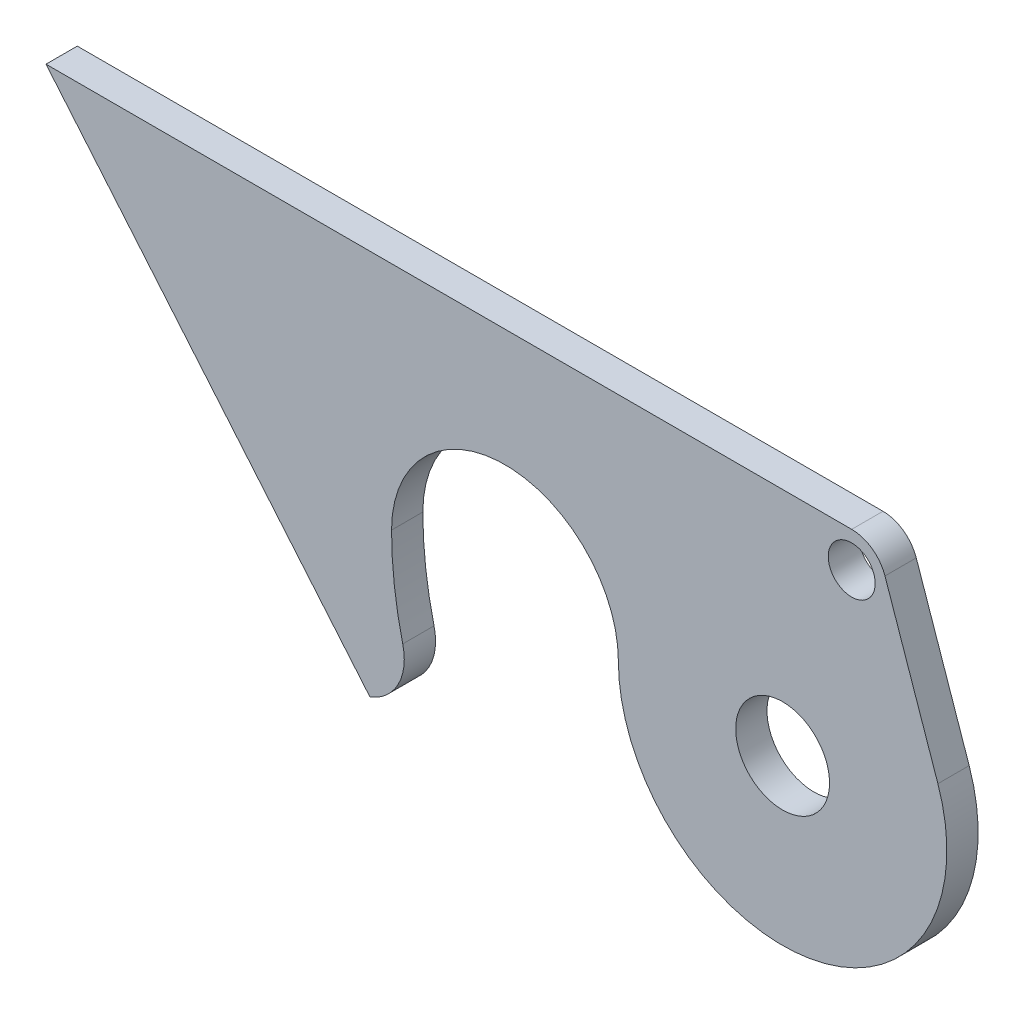
ISO-10303-21;
HEADER;
FILE_DESCRIPTION(('STEP AP214'),'2;1');
FILE_NAME('part.step','',(''),(''),'','','');
FILE_SCHEMA(('AUTOMOTIVE_DESIGN { 1 0 10303 214 1 1 1 1 }'));
ENDSEC;
DATA;
#1=APPLICATION_CONTEXT('core data for automotive mechanical design processes');
#2=APPLICATION_PROTOCOL_DEFINITION('international standard','automotive_design',2000,#1);
#3=PRODUCT_CONTEXT('',#1,'mechanical');
#4=PRODUCT('Part','Part','',(#3));
#5=PRODUCT_RELATED_PRODUCT_CATEGORY('part','',(#4));
#6=PRODUCT_DEFINITION_FORMATION('','',#4);
#7=PRODUCT_DEFINITION_CONTEXT('part definition',#1,'design');
#8=PRODUCT_DEFINITION('design','',#6,#7);
#9=PRODUCT_DEFINITION_SHAPE('','',#8);
#10=(LENGTH_UNIT() NAMED_UNIT(*) SI_UNIT(.MILLI.,.METRE.));
#11=(NAMED_UNIT(*) PLANE_ANGLE_UNIT() SI_UNIT($,.RADIAN.));
#12=(NAMED_UNIT(*) SI_UNIT($,.STERADIAN.) SOLID_ANGLE_UNIT());
#13=UNCERTAINTY_MEASURE_WITH_UNIT(LENGTH_MEASURE(1.E-05),#10,'distance_accuracy_value','');
#14=(GEOMETRIC_REPRESENTATION_CONTEXT(3) GLOBAL_UNCERTAINTY_ASSIGNED_CONTEXT((#13)) GLOBAL_UNIT_ASSIGNED_CONTEXT((#10,
#11,#12)) REPRESENTATION_CONTEXT('',''));
#15=CARTESIAN_POINT('',(0.,0.,0.));
#16=DIRECTION('',(0.,0.,1.));
#17=DIRECTION('',(1.,0.,0.));
#18=AXIS2_PLACEMENT_3D('',#15,#16,#17);
#19=CARTESIAN_POINT('',(-35.5,0.,-4.));
#20=DIRECTION('',(0.,0.,1.));
#21=DIRECTION('',(1.,0.,0.));
#22=AXIS2_PLACEMENT_3D('',#19,#20,#21);
#23=CYLINDRICAL_SURFACE('',#22,14.5);
#24=CARTESIAN_POINT('',(-35.5,0.,0.));
#25=DIRECTION('',(0.,0.,-1.));
#26=DIRECTION('',(1.,0.,0.));
#27=AXIS2_PLACEMENT_3D('',#24,#25,#26);
#28=CIRCLE('',#27,14.5);
#29=CARTESIAN_POINT('',(-50.,0.,0.));
#30=VERTEX_POINT('',#29);
#31=CARTESIAN_POINT('',(-21.,0.,0.));
#32=VERTEX_POINT('',#31);
#33=EDGE_CURVE('E134',#30,#32,#28,.T.);
#34=ORIENTED_EDGE('',*,*,#33,.F.);
#35=DIRECTION('',(0.,0.,1.));
#36=VECTOR('',#35,1.);
#37=CARTESIAN_POINT('',(-50.,0.,-4.));
#38=LINE('',#37,#36);
#39=CARTESIAN_POINT('',(-50.,0.,-4.));
#40=VERTEX_POINT('',#39);
#41=EDGE_CURVE('E11',#40,#30,#38,.T.);
#42=ORIENTED_EDGE('',*,*,#41,.F.);
#43=CARTESIAN_POINT('',(-35.5,0.,-4.));
#44=DIRECTION('',(0.,0.,-1.));
#45=DIRECTION('',(1.,0.,0.));
#46=AXIS2_PLACEMENT_3D('',#43,#44,#45);
#47=CIRCLE('',#46,14.5);
#48=CARTESIAN_POINT('',(-21.,0.,-4.));
#49=VERTEX_POINT('',#48);
#50=EDGE_CURVE('E155',#40,#49,#47,.T.);
#51=ORIENTED_EDGE('',*,*,#50,.T.);
#52=DIRECTION('',(0.,0.,1.));
#53=VECTOR('',#52,1.);
#54=CARTESIAN_POINT('',(-21.,0.,-4.));
#55=LINE('',#54,#53);
#56=EDGE_CURVE('E40',#49,#32,#55,.T.);
#57=ORIENTED_EDGE('',*,*,#56,.T.);
#58=EDGE_LOOP('',(#34,#42,#51,#57));
#59=FACE_BOUND('',#58,.T.);
#60=ADVANCED_FACE('F37',(#59),#23,.F.);
#61=CARTESIAN_POINT('',(0.,0.,-4.));
#62=DIRECTION('',(0.,0.,1.));
#63=DIRECTION('',(1.,0.,0.));
#64=AXIS2_PLACEMENT_3D('',#61,#62,#63);
#65=CYLINDRICAL_SURFACE('',#64,50.);
#66=CARTESIAN_POINT('',(0.,0.,0.));
#67=DIRECTION('',(0.,0.,-1.));
#68=DIRECTION('',(1.,0.,0.));
#69=AXIS2_PLACEMENT_3D('',#66,#67,#68);
#70=CIRCLE('',#69,50.);
#71=CARTESIAN_POINT('',(-48.5665379161614,-11.8866056903581,0.));
#72=VERTEX_POINT('',#71);
#73=EDGE_CURVE('E153',#72,#30,#70,.T.);
#74=ORIENTED_EDGE('',*,*,#73,.F.);
#75=DIRECTION('',(0.,0.,1.));
#76=VECTOR('',#75,1.);
#77=CARTESIAN_POINT('',(-48.5665379161614,-11.8866056903581,-4.));
#78=LINE('',#77,#76);
#79=CARTESIAN_POINT('',(-48.5665379161614,-11.8866056903581,-4.));
#80=VERTEX_POINT('',#79);
#81=EDGE_CURVE('E46',#80,#72,#78,.T.);
#82=ORIENTED_EDGE('',*,*,#81,.F.);
#83=CARTESIAN_POINT('',(0.,0.,-4.));
#84=DIRECTION('',(0.,0.,-1.));
#85=DIRECTION('',(1.,0.,0.));
#86=AXIS2_PLACEMENT_3D('',#83,#84,#85);
#87=CIRCLE('',#86,50.);
#88=EDGE_CURVE('E123',#80,#40,#87,.T.);
#89=ORIENTED_EDGE('',*,*,#88,.T.);
#90=ORIENTED_EDGE('',*,*,#41,.T.);
#91=EDGE_LOOP('',(#74,#82,#89,#90));
#92=FACE_BOUND('',#91,.T.);
#93=ADVANCED_FACE('F168',(#92),#65,.F.);
#94=CARTESIAN_POINT('',(-55.1585775575961,-13.5,-4.));
#95=DIRECTION('',(0.,0.,1.));
#96=DIRECTION('',(1.,0.,0.));
#97=AXIS2_PLACEMENT_3D('',#94,#95,#96);
#98=CYLINDRICAL_SURFACE('',#97,6.78660650344715);
#99=CARTESIAN_POINT('',(-55.1585775575961,-13.5,0.));
#100=DIRECTION('',(0.,0.,1.));
#101=DIRECTION('',(1.,0.,0.));
#102=AXIS2_PLACEMENT_3D('',#99,#100,#101);
#103=CIRCLE('',#102,6.78660650344715);
#104=CARTESIAN_POINT('',(-52.768927380326,-19.8519760596923,0.));
#105=VERTEX_POINT('',#104);
#106=EDGE_CURVE('E111',#105,#72,#103,.T.);
#107=ORIENTED_EDGE('',*,*,#106,.F.);
#108=DIRECTION('',(0.,0.,1.));
#109=VECTOR('',#108,1.);
#110=CARTESIAN_POINT('',(-52.768927380326,-19.8519760596923,-4.));
#111=LINE('',#110,#109);
#112=CARTESIAN_POINT('',(-52.768927380326,-19.8519760596923,-4.));
#113=VERTEX_POINT('',#112);
#114=EDGE_CURVE('E106',#113,#105,#111,.T.);
#115=ORIENTED_EDGE('',*,*,#114,.F.);
#116=CARTESIAN_POINT('',(-55.1585775575961,-13.5,-4.));
#117=DIRECTION('',(0.,0.,1.));
#118=DIRECTION('',(1.,0.,0.));
#119=AXIS2_PLACEMENT_3D('',#116,#117,#118);
#120=CIRCLE('',#119,6.78660650344715);
#121=EDGE_CURVE('E109',#113,#80,#120,.T.);
#122=ORIENTED_EDGE('',*,*,#121,.T.);
#123=ORIENTED_EDGE('',*,*,#81,.T.);
#124=EDGE_LOOP('',(#107,#115,#122,#123));
#125=FACE_BOUND('',#124,.T.);
#126=ADVANCED_FACE('F108',(#125),#98,.T.);
#127=CARTESIAN_POINT('',(-52.768927380326,-19.8519760596923,-4.));
#128=DIRECTION('',(-0.766044443118974,-0.642787609686544,0.));
#129=DIRECTION('',(0.642787609686544,-0.766044443118974,0.));
#130=AXIS2_PLACEMENT_3D('',#127,#128,#129);
#131=PLANE('',#130);
#132=DIRECTION('',(0.642787609686544,-0.766044443118974,0.));
#133=VECTOR('',#132,1.);
#134=CARTESIAN_POINT('',(-52.768927380326,-19.8519760596923,0.));
#135=LINE('',#134,#133);
#136=CARTESIAN_POINT('',(-94.1801522898842,29.5,0.));
#137=VERTEX_POINT('',#136);
#138=EDGE_CURVE('E150',#137,#105,#135,.T.);
#139=ORIENTED_EDGE('',*,*,#138,.F.);
#140=DIRECTION('',(0.,0.,1.));
#141=VECTOR('',#140,1.);
#142=CARTESIAN_POINT('',(-94.1801522898842,29.5,-4.));
#143=LINE('',#142,#141);
#144=CARTESIAN_POINT('',(-94.1801522898842,29.5,-4.));
#145=VERTEX_POINT('',#144);
#146=EDGE_CURVE('E116',#145,#137,#143,.T.);
#147=ORIENTED_EDGE('',*,*,#146,.F.);
#148=DIRECTION('',(0.642787609686544,-0.766044443118974,0.));
#149=VECTOR('',#148,1.);
#150=CARTESIAN_POINT('',(-52.768927380326,-19.8519760596923,-4.));
#151=LINE('',#150,#149);
#152=EDGE_CURVE('E122',#145,#113,#151,.T.);
#153=ORIENTED_EDGE('',*,*,#152,.T.);
#154=ORIENTED_EDGE('',*,*,#114,.T.);
#155=EDGE_LOOP('',(#139,#147,#153,#154));
#156=FACE_BOUND('',#155,.T.);
#157=ADVANCED_FACE('F126',(#156),#131,.T.);
#158=CARTESIAN_POINT('',(-94.1801522898842,29.5,-4.));
#159=DIRECTION('',(0.,1.,0.));
#160=DIRECTION('',(0.,0.,1.));
#161=AXIS2_PLACEMENT_3D('',#158,#159,#160);
#162=PLANE('',#161);
#163=DIRECTION('',(-1.,0.,0.));
#164=VECTOR('',#163,1.);
#165=CARTESIAN_POINT('',(-94.1801522898842,29.5,0.));
#166=LINE('',#165,#164);
#167=CARTESIAN_POINT('',(8.83274998710915,29.5,0.));
#168=VERTEX_POINT('',#167);
#169=EDGE_CURVE('E147',#168,#137,#166,.T.);
#170=ORIENTED_EDGE('',*,*,#169,.F.);
#171=DIRECTION('',(0.,0.,1.));
#172=VECTOR('',#171,1.);
#173=CARTESIAN_POINT('',(8.83274998710915,29.5,-4.));
#174=LINE('',#173,#172);
#175=CARTESIAN_POINT('',(8.83274998710915,29.5,-4.));
#176=VERTEX_POINT('',#175);
#177=EDGE_CURVE('E159',#176,#168,#174,.T.);
#178=ORIENTED_EDGE('',*,*,#177,.F.);
#179=DIRECTION('',(-1.,0.,0.));
#180=VECTOR('',#179,1.);
#181=CARTESIAN_POINT('',(0.,29.5,-4.));
#182=LINE('',#181,#180);
#183=EDGE_CURVE('E127',#176,#145,#182,.T.);
#184=ORIENTED_EDGE('',*,*,#183,.T.);
#185=ORIENTED_EDGE('',*,*,#146,.T.);
#186=EDGE_LOOP('',(#170,#178,#184,#185));
#187=FACE_BOUND('',#186,.T.);
#188=ADVANCED_FACE('F181',(#187),#162,.T.);
#189=CARTESIAN_POINT('',(8.83274998710915,25.0000000000065,-4.));
#190=DIRECTION('',(0.,0.,1.));
#191=DIRECTION('',(1.,0.,0.));
#192=AXIS2_PLACEMENT_3D('',#189,#190,#191);
#193=CYLINDRICAL_SURFACE('',#192,4.49999999999351);
#194=CARTESIAN_POINT('',(8.83274998710915,25.0000000000065,0.));
#195=DIRECTION('',(0.,0.,1.));
#196=DIRECTION('',(1.,0.,0.));
#197=AXIS2_PLACEMENT_3D('',#194,#195,#196);
#198=CIRCLE('',#197,4.49999999999351);
#199=CARTESIAN_POINT('',(13.0869291306046,26.4669559690082,0.));
#200=VERTEX_POINT('',#199);
#201=EDGE_CURVE('E144',#200,#168,#198,.T.);
#202=ORIENTED_EDGE('',*,*,#201,.F.);
#203=DIRECTION('',(0.,0.,1.));
#204=VECTOR('',#203,1.);
#205=CARTESIAN_POINT('',(13.0869291306046,26.4669559690082,-4.));
#206=LINE('',#205,#204);
#207=CARTESIAN_POINT('',(13.0869291306046,26.4669559690082,-4.));
#208=VERTEX_POINT('',#207);
#209=EDGE_CURVE('E162',#208,#200,#206,.T.);
#210=ORIENTED_EDGE('',*,*,#209,.F.);
#211=CARTESIAN_POINT('',(8.83274998710915,25.0000000000065,-4.));
#212=DIRECTION('',(0.,0.,1.));
#213=DIRECTION('',(1.,0.,0.));
#214=AXIS2_PLACEMENT_3D('',#211,#212,#213);
#215=CIRCLE('',#214,4.49999999999351);
#216=EDGE_CURVE('E129',#208,#176,#215,.T.);
#217=ORIENTED_EDGE('',*,*,#216,.T.);
#218=ORIENTED_EDGE('',*,*,#177,.T.);
#219=EDGE_LOOP('',(#202,#210,#217,#218));
#220=FACE_BOUND('',#219,.T.);
#221=ADVANCED_FACE('F184',(#220),#193,.T.);
#222=CARTESIAN_POINT('',(13.0869291306046,26.4669559690082,-4.));
#223=DIRECTION('',(0.945373143000355,0.325990215334187,0.));
#224=DIRECTION('',(-0.325990215334187,0.945373143000355,0.));
#225=AXIS2_PLACEMENT_3D('',#222,#223,#224);
#226=PLANE('',#225);
#227=DIRECTION('',(-0.325990215334187,0.945373143000355,0.));
#228=VECTOR('',#227,1.);
#229=CARTESIAN_POINT('',(13.0869291306046,26.4669559690082,0.));
#230=LINE('',#229,#228);
#231=CARTESIAN_POINT('',(19.8528360030075,6.84579452201794,0.));
#232=VERTEX_POINT('',#231);
#233=EDGE_CURVE('E141',#232,#200,#230,.T.);
#234=ORIENTED_EDGE('',*,*,#233,.F.);
#235=DIRECTION('',(0.,0.,1.));
#236=VECTOR('',#235,1.);
#237=CARTESIAN_POINT('',(19.8528360030075,6.84579452201794,-4.));
#238=LINE('',#237,#236);
#239=CARTESIAN_POINT('',(19.8528360030075,6.84579452201794,-4.));
#240=VERTEX_POINT('',#239);
#241=EDGE_CURVE('E163',#240,#232,#238,.T.);
#242=ORIENTED_EDGE('',*,*,#241,.F.);
#243=DIRECTION('',(-0.325990215334187,0.945373143000355,0.));
#244=VECTOR('',#243,1.);
#245=CARTESIAN_POINT('',(13.0869291306046,26.4669559690082,-4.));
#246=LINE('',#245,#244);
#247=EDGE_CURVE('E230',#240,#208,#246,.T.);
#248=ORIENTED_EDGE('',*,*,#247,.T.);
#249=ORIENTED_EDGE('',*,*,#209,.T.);
#250=EDGE_LOOP('',(#234,#242,#248,#249));
#251=FACE_BOUND('',#250,.T.);
#252=ADVANCED_FACE('F188',(#251),#226,.T.);
#253=CARTESIAN_POINT('',(0.,0.,-4.));
#254=DIRECTION('',(0.,0.,1.));
#255=DIRECTION('',(1.,0.,0.));
#256=AXIS2_PLACEMENT_3D('',#253,#254,#255);
#257=CYLINDRICAL_SURFACE('',#256,21.);
#258=CARTESIAN_POINT('',(0.,0.,0.));
#259=DIRECTION('',(0.,0.,1.));
#260=DIRECTION('',(1.,0.,0.));
#261=AXIS2_PLACEMENT_3D('',#258,#259,#260);
#262=CIRCLE('',#261,21.);
#263=EDGE_CURVE('E137',#32,#232,#262,.T.);
#264=ORIENTED_EDGE('',*,*,#263,.F.);
#265=ORIENTED_EDGE('',*,*,#56,.F.);
#266=CARTESIAN_POINT('',(0.,0.,-4.));
#267=DIRECTION('',(0.,0.,1.));
#268=DIRECTION('',(1.,0.,0.));
#269=AXIS2_PLACEMENT_3D('',#266,#267,#268);
#270=CIRCLE('',#269,21.);
#271=EDGE_CURVE('E228',#49,#240,#270,.T.);
#272=ORIENTED_EDGE('',*,*,#271,.T.);
#273=ORIENTED_EDGE('',*,*,#241,.T.);
#274=EDGE_LOOP('',(#264,#265,#272,#273));
#275=FACE_BOUND('',#274,.T.);
#276=ADVANCED_FACE('F165',(#275),#257,.T.);
#277=CARTESIAN_POINT('',(-35.5,0.,-4.));
#278=DIRECTION('',(0.,0.,1.));
#279=DIRECTION('',(1.,0.,0.));
#280=AXIS2_PLACEMENT_3D('',#277,#278,#279);
#281=PLANE('',#280);
#282=CARTESIAN_POINT('',(8.83274998710915,25.0000000000065,-4.));
#283=DIRECTION('',(0.,0.,1.));
#284=DIRECTION('',(1.,0.,0.));
#285=AXIS2_PLACEMENT_3D('',#282,#283,#284);
#286=CIRCLE('',#285,3.);
#287=CARTESIAN_POINT('',(11.8327499871091,25.0000000000065,-4.));
#288=VERTEX_POINT('',#287);
#289=EDGE_CURVE('E215',#288,#288,#286,.T.);
#290=ORIENTED_EDGE('',*,*,#289,.T.);
#291=EDGE_LOOP('',(#290));
#292=FACE_BOUND('',#291,.T.);
#293=CARTESIAN_POINT('',(0.,0.,-4.));
#294=DIRECTION('',(0.,0.,1.));
#295=DIRECTION('',(1.,0.,0.));
#296=AXIS2_PLACEMENT_3D('',#293,#294,#295);
#297=CIRCLE('',#296,6.00000000000001);
#298=CARTESIAN_POINT('',(6.00000000000001,0.,-4.));
#299=VERTEX_POINT('',#298);
#300=EDGE_CURVE('E138',#299,#299,#297,.T.);
#301=ORIENTED_EDGE('',*,*,#300,.T.);
#302=EDGE_LOOP('',(#301));
#303=FACE_BOUND('',#302,.T.);
#304=ORIENTED_EDGE('',*,*,#50,.F.);
#305=ORIENTED_EDGE('',*,*,#88,.F.);
#306=ORIENTED_EDGE('',*,*,#121,.F.);
#307=ORIENTED_EDGE('',*,*,#152,.F.);
#308=ORIENTED_EDGE('',*,*,#183,.F.);
#309=ORIENTED_EDGE('',*,*,#216,.F.);
#310=ORIENTED_EDGE('',*,*,#247,.F.);
#311=ORIENTED_EDGE('',*,*,#271,.F.);
#312=EDGE_LOOP('',(#304,#305,#306,#307,#308,#309,#310,#311));
#313=FACE_BOUND('',#312,.T.);
#314=ADVANCED_FACE('F120',(#292,#303,#313),#281,.F.);
#315=CARTESIAN_POINT('',(-35.5,0.,0.));
#316=DIRECTION('',(0.,0.,1.));
#317=DIRECTION('',(1.,0.,0.));
#318=AXIS2_PLACEMENT_3D('',#315,#316,#317);
#319=PLANE('',#318);
#320=CARTESIAN_POINT('',(8.83274998710915,25.0000000000065,0.));
#321=DIRECTION('',(0.,0.,1.));
#322=DIRECTION('',(1.,0.,0.));
#323=AXIS2_PLACEMENT_3D('',#320,#321,#322);
#324=CIRCLE('',#323,3.);
#325=CARTESIAN_POINT('',(11.8327499871091,25.0000000000065,0.));
#326=VERTEX_POINT('',#325);
#327=EDGE_CURVE('E218',#326,#326,#324,.T.);
#328=ORIENTED_EDGE('',*,*,#327,.F.);
#329=EDGE_LOOP('',(#328));
#330=FACE_BOUND('',#329,.T.);
#331=CARTESIAN_POINT('',(0.,0.,0.));
#332=DIRECTION('',(0.,0.,1.));
#333=DIRECTION('',(1.,0.,0.));
#334=AXIS2_PLACEMENT_3D('',#331,#332,#333);
#335=CIRCLE('',#334,6.00000000000001);
#336=CARTESIAN_POINT('',(6.00000000000001,0.,0.));
#337=VERTEX_POINT('',#336);
#338=EDGE_CURVE('E220',#337,#337,#335,.T.);
#339=ORIENTED_EDGE('',*,*,#338,.F.);
#340=EDGE_LOOP('',(#339));
#341=FACE_BOUND('',#340,.T.);
#342=ORIENTED_EDGE('',*,*,#33,.T.);
#343=ORIENTED_EDGE('',*,*,#263,.T.);
#344=ORIENTED_EDGE('',*,*,#233,.T.);
#345=ORIENTED_EDGE('',*,*,#201,.T.);
#346=ORIENTED_EDGE('',*,*,#169,.T.);
#347=ORIENTED_EDGE('',*,*,#138,.T.);
#348=ORIENTED_EDGE('',*,*,#106,.T.);
#349=ORIENTED_EDGE('',*,*,#73,.T.);
#350=EDGE_LOOP('',(#342,#343,#344,#345,#346,#347,#348,#349));
#351=FACE_BOUND('',#350,.T.);
#352=ADVANCED_FACE('F167',(#330,#341,#351),#319,.T.);
#353=CARTESIAN_POINT('',(0.,0.,-4.));
#354=DIRECTION('',(0.,0.,1.));
#355=DIRECTION('',(1.,0.,0.));
#356=AXIS2_PLACEMENT_3D('',#353,#354,#355);
#357=CYLINDRICAL_SURFACE('',#356,6.00000000000001);
#358=ORIENTED_EDGE('',*,*,#300,.F.);
#359=EDGE_LOOP('',(#358));
#360=FACE_BOUND('',#359,.T.);
#361=ORIENTED_EDGE('',*,*,#338,.T.);
#362=EDGE_LOOP('',(#361));
#363=FACE_BOUND('',#362,.T.);
#364=ADVANCED_FACE('F200',(#360,#363),#357,.F.);
#365=CARTESIAN_POINT('',(8.83274998710915,25.0000000000065,-4.));
#366=DIRECTION('',(0.,0.,1.));
#367=DIRECTION('',(1.,0.,0.));
#368=AXIS2_PLACEMENT_3D('',#365,#366,#367);
#369=CYLINDRICAL_SURFACE('',#368,3.);
#370=ORIENTED_EDGE('',*,*,#289,.F.);
#371=EDGE_LOOP('',(#370));
#372=FACE_BOUND('',#371,.T.);
#373=ORIENTED_EDGE('',*,*,#327,.T.);
#374=EDGE_LOOP('',(#373));
#375=FACE_BOUND('',#374,.T.);
#376=ADVANCED_FACE('F207',(#372,#375),#369,.F.);
#377=CLOSED_SHELL('',(#60,#93,#126,#157,#188,#221,#252,#276,#314,#352,#364,#376));
#378=MANIFOLD_SOLID_BREP('B2',#377);
#379=ADVANCED_BREP_SHAPE_REPRESENTATION('',(#18,#378),#14);
#380=SHAPE_DEFINITION_REPRESENTATION(#9,#379);
ENDSEC;
END-ISO-10303-21;
